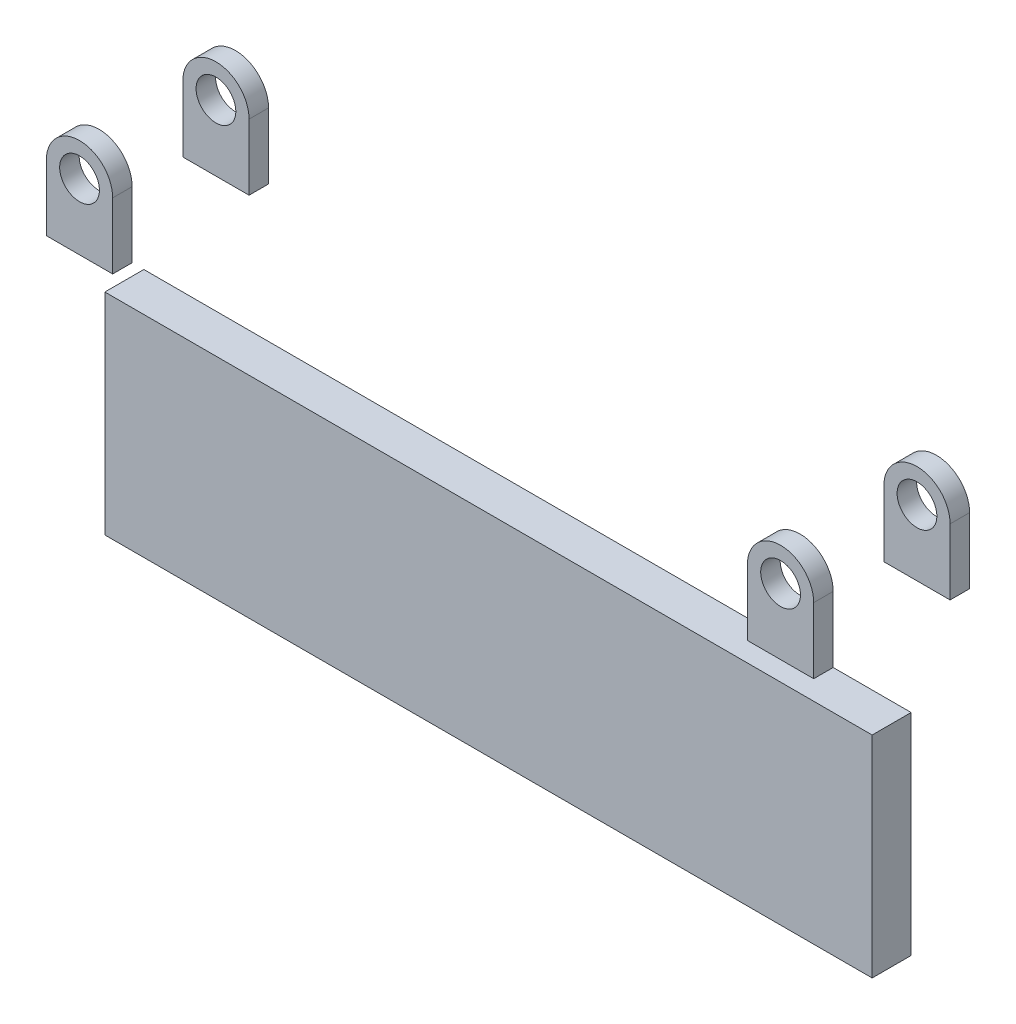
ISO-10303-21;
HEADER;
FILE_DESCRIPTION(('STEP AP214'),'2;1');
FILE_NAME('part.step','',(''),(''),'','','');
FILE_SCHEMA(('AUTOMOTIVE_DESIGN { 1 0 10303 214 1 1 1 1 }'));
ENDSEC;
DATA;
#1=APPLICATION_CONTEXT('core data for automotive mechanical design processes');
#2=APPLICATION_PROTOCOL_DEFINITION('international standard','automotive_design',2000,#1);
#3=PRODUCT_CONTEXT('',#1,'mechanical');
#4=PRODUCT('Part','Part','',(#3));
#5=PRODUCT_RELATED_PRODUCT_CATEGORY('part','',(#4));
#6=PRODUCT_DEFINITION_FORMATION('','',#4);
#7=PRODUCT_DEFINITION_CONTEXT('part definition',#1,'design');
#8=PRODUCT_DEFINITION('design','',#6,#7);
#9=PRODUCT_DEFINITION_SHAPE('','',#8);
#10=(LENGTH_UNIT() NAMED_UNIT(*) SI_UNIT(.MILLI.,.METRE.));
#11=(NAMED_UNIT(*) PLANE_ANGLE_UNIT() SI_UNIT($,.RADIAN.));
#12=(NAMED_UNIT(*) SI_UNIT($,.STERADIAN.) SOLID_ANGLE_UNIT());
#13=UNCERTAINTY_MEASURE_WITH_UNIT(LENGTH_MEASURE(1.E-05),#10,'distance_accuracy_value','');
#14=(GEOMETRIC_REPRESENTATION_CONTEXT(3) GLOBAL_UNCERTAINTY_ASSIGNED_CONTEXT((#13)) GLOBAL_UNIT_ASSIGNED_CONTEXT((#10,
#11,#12)) REPRESENTATION_CONTEXT('',''));
#15=CARTESIAN_POINT('',(0.,0.,0.));
#16=DIRECTION('',(0.,0.,1.));
#17=DIRECTION('',(1.,0.,0.));
#18=AXIS2_PLACEMENT_3D('',#15,#16,#17);
#19=CARTESIAN_POINT('',(-10.795,-115.457155865478,31.75));
#20=DIRECTION('',(1.,0.,0.));
#21=DIRECTION('',(0.,1.,0.));
#22=AXIS2_PLACEMENT_3D('',#19,#20,#21);
#23=PLANE('',#22);
#24=DIRECTION('',(0.,0.,1.));
#25=VECTOR('',#24,1.);
#26=CARTESIAN_POINT('',(-10.795,-46.8771558654777,19.05));
#27=LINE('',#26,#25);
#28=CARTESIAN_POINT('',(-10.795,-46.8771558654777,19.05));
#29=VERTEX_POINT('',#28);
#30=CARTESIAN_POINT('',(-10.795,-46.8771558654777,31.75));
#31=VERTEX_POINT('',#30);
#32=EDGE_CURVE('E65',#29,#31,#27,.T.);
#33=ORIENTED_EDGE('',*,*,#32,.F.);
#34=DIRECTION('',(0.,1.,0.));
#35=VECTOR('',#34,1.);
#36=CARTESIAN_POINT('',(-10.795,-115.457155865478,19.05));
#37=LINE('',#36,#35);
#38=CARTESIAN_POINT('',(-10.795,-115.457155865478,19.05));
#39=VERTEX_POINT('',#38);
#40=EDGE_CURVE('E12',#39,#29,#37,.T.);
#41=ORIENTED_EDGE('',*,*,#40,.F.);
#42=DIRECTION('',(0.,0.,-1.));
#43=VECTOR('',#42,1.);
#44=CARTESIAN_POINT('',(-10.795,-115.457155865478,31.75));
#45=LINE('',#44,#43);
#46=CARTESIAN_POINT('',(-10.795,-115.457155865478,31.75));
#47=VERTEX_POINT('',#46);
#48=EDGE_CURVE('E112',#47,#39,#45,.T.);
#49=ORIENTED_EDGE('',*,*,#48,.F.);
#50=DIRECTION('',(0.,1.,0.));
#51=VECTOR('',#50,1.);
#52=CARTESIAN_POINT('',(-10.795,-115.457155865478,31.75));
#53=LINE('',#52,#51);
#54=EDGE_CURVE('E103',#47,#31,#53,.T.);
#55=ORIENTED_EDGE('',*,*,#54,.T.);
#56=EDGE_LOOP('',(#33,#41,#49,#55));
#57=FACE_BOUND('',#56,.T.);
#58=ADVANCED_FACE('F50',(#57),#23,.F.);
#59=CARTESIAN_POINT('',(-10.795,-115.457155865478,19.05));
#60=DIRECTION('',(0.,0.,1.));
#61=DIRECTION('',(1.,0.,0.));
#62=AXIS2_PLACEMENT_3D('',#59,#60,#61);
#63=PLANE('',#62);
#64=DIRECTION('',(-1.,0.,0.));
#65=VECTOR('',#64,1.);
#66=CARTESIAN_POINT('',(239.2426,-46.8771558654776,19.05));
#67=LINE('',#66,#65);
#68=CARTESIAN_POINT('',(239.2426,-46.8771558654776,19.05));
#69=VERTEX_POINT('',#68);
#70=EDGE_CURVE('E90',#69,#29,#67,.T.);
#71=ORIENTED_EDGE('',*,*,#70,.F.);
#72=DIRECTION('',(0.,1.,0.));
#73=VECTOR('',#72,1.);
#74=CARTESIAN_POINT('',(239.2426,-115.457155865478,19.05));
#75=LINE('',#74,#73);
#76=CARTESIAN_POINT('',(239.2426,-115.457155865478,19.05));
#77=VERTEX_POINT('',#76);
#78=EDGE_CURVE('E58',#77,#69,#75,.T.);
#79=ORIENTED_EDGE('',*,*,#78,.F.);
#80=DIRECTION('',(1.,0.,0.));
#81=VECTOR('',#80,1.);
#82=CARTESIAN_POINT('',(-10.795,-115.457155865478,19.05));
#83=LINE('',#82,#81);
#84=EDGE_CURVE('E108',#39,#77,#83,.T.);
#85=ORIENTED_EDGE('',*,*,#84,.F.);
#86=ORIENTED_EDGE('',*,*,#40,.T.);
#87=EDGE_LOOP('',(#71,#79,#85,#86));
#88=FACE_BOUND('',#87,.T.);
#89=ADVANCED_FACE('F107',(#88),#63,.F.);
#90=CARTESIAN_POINT('',(239.2426,-115.457155865478,31.75));
#91=DIRECTION('',(-1.,0.,0.));
#92=DIRECTION('',(0.,-1.,0.));
#93=AXIS2_PLACEMENT_3D('',#90,#91,#92);
#94=PLANE('',#93);
#95=DIRECTION('',(0.,0.,-1.));
#96=VECTOR('',#95,1.);
#97=CARTESIAN_POINT('',(239.2426,-46.8771558654776,31.75));
#98=LINE('',#97,#96);
#99=CARTESIAN_POINT('',(239.2426,-46.8771558654776,31.75));
#100=VERTEX_POINT('',#99);
#101=EDGE_CURVE('E93',#100,#69,#98,.T.);
#102=ORIENTED_EDGE('',*,*,#101,.F.);
#103=DIRECTION('',(0.,1.,0.));
#104=VECTOR('',#103,1.);
#105=CARTESIAN_POINT('',(239.2426,-115.457155865478,31.75));
#106=LINE('',#105,#104);
#107=CARTESIAN_POINT('',(239.2426,-115.457155865478,31.75));
#108=VERTEX_POINT('',#107);
#109=EDGE_CURVE('E127',#108,#100,#106,.T.);
#110=ORIENTED_EDGE('',*,*,#109,.F.);
#111=DIRECTION('',(0.,0.,1.));
#112=VECTOR('',#111,1.);
#113=CARTESIAN_POINT('',(239.2426,-115.457155865478,31.75));
#114=LINE('',#113,#112);
#115=EDGE_CURVE('E111',#77,#108,#114,.T.);
#116=ORIENTED_EDGE('',*,*,#115,.F.);
#117=ORIENTED_EDGE('',*,*,#78,.T.);
#118=EDGE_LOOP('',(#102,#110,#116,#117));
#119=FACE_BOUND('',#118,.T.);
#120=ADVANCED_FACE('F132',(#119),#94,.F.);
#121=CARTESIAN_POINT('',(-10.795,-115.457155865478,31.75));
#122=DIRECTION('',(0.,0.,-1.));
#123=DIRECTION('',(-1.,0.,0.));
#124=AXIS2_PLACEMENT_3D('',#121,#122,#123);
#125=PLANE('',#124);
#126=DIRECTION('',(1.,0.,0.));
#127=VECTOR('',#126,1.);
#128=CARTESIAN_POINT('',(-10.795,-46.8771558654777,31.75));
#129=LINE('',#128,#127);
#130=EDGE_CURVE('E105',#31,#100,#129,.T.);
#131=ORIENTED_EDGE('',*,*,#130,.F.);
#132=ORIENTED_EDGE('',*,*,#54,.F.);
#133=DIRECTION('',(-1.,0.,0.));
#134=VECTOR('',#133,1.);
#135=CARTESIAN_POINT('',(-10.795,-115.457155865478,31.75));
#136=LINE('',#135,#134);
#137=EDGE_CURVE('E73',#108,#47,#136,.T.);
#138=ORIENTED_EDGE('',*,*,#137,.F.);
#139=ORIENTED_EDGE('',*,*,#109,.T.);
#140=EDGE_LOOP('',(#131,#132,#138,#139));
#141=FACE_BOUND('',#140,.T.);
#142=ADVANCED_FACE('F135',(#141),#125,.F.);
#143=CARTESIAN_POINT('',(0.,-115.457155865478,0.));
#144=DIRECTION('',(0.,-1.,0.));
#145=DIRECTION('',(1.,0.,0.));
#146=AXIS2_PLACEMENT_3D('',#143,#144,#145);
#147=PLANE('',#146);
#148=ORIENTED_EDGE('',*,*,#48,.T.);
#149=ORIENTED_EDGE('',*,*,#84,.T.);
#150=ORIENTED_EDGE('',*,*,#115,.T.);
#151=ORIENTED_EDGE('',*,*,#137,.T.);
#152=EDGE_LOOP('',(#148,#149,#150,#151));
#153=FACE_BOUND('',#152,.T.);
#154=ADVANCED_FACE('F114',(#153),#147,.T.);
#155=CARTESIAN_POINT('',(0.,-46.8771558654777,0.));
#156=DIRECTION('',(0.,1.,0.));
#157=DIRECTION('',(-1.,0.,0.));
#158=AXIS2_PLACEMENT_3D('',#155,#156,#157);
#159=PLANE('',#158);
#160=ORIENTED_EDGE('',*,*,#70,.T.);
#161=ORIENTED_EDGE('',*,*,#32,.T.);
#162=ORIENTED_EDGE('',*,*,#130,.T.);
#163=ORIENTED_EDGE('',*,*,#101,.T.);
#164=EDGE_LOOP('',(#160,#161,#162,#163));
#165=FACE_BOUND('',#164,.T.);
#166=ADVANCED_FACE('F91',(#165),#159,.T.);
#167=CLOSED_SHELL('',(#58,#89,#120,#142,#154,#166));
#168=MANIFOLD_SOLID_BREP('B2',#167);
#169=CARTESIAN_POINT('',(228.4476,0.,50.8));
#170=DIRECTION('',(0.,0.,-1.));
#171=DIRECTION('',(-1.,0.,0.));
#172=AXIS2_PLACEMENT_3D('',#169,#170,#171);
#173=CYLINDRICAL_SURFACE('',#172,10.795);
#174=DIRECTION('',(0.,0.,-1.));
#175=VECTOR('',#174,1.);
#176=CARTESIAN_POINT('',(239.2426,0.,50.8));
#177=LINE('',#176,#175);
#178=CARTESIAN_POINT('',(239.2426,0.,50.8));
#179=VERTEX_POINT('',#178);
#180=CARTESIAN_POINT('',(239.2426,0.,44.45));
#181=VERTEX_POINT('',#180);
#182=EDGE_CURVE('E199',#179,#181,#177,.T.);
#183=ORIENTED_EDGE('',*,*,#182,.T.);
#184=CARTESIAN_POINT('',(228.4476,0.,44.45));
#185=DIRECTION('',(0.,0.,1.));
#186=DIRECTION('',(1.,0.,0.));
#187=AXIS2_PLACEMENT_3D('',#184,#185,#186);
#188=CIRCLE('',#187,10.795);
#189=CARTESIAN_POINT('',(217.6526,0.,44.45));
#190=VERTEX_POINT('',#189);
#191=EDGE_CURVE('E213',#181,#190,#188,.T.);
#192=ORIENTED_EDGE('',*,*,#191,.T.);
#193=DIRECTION('',(0.,0.,-1.));
#194=VECTOR('',#193,1.);
#195=CARTESIAN_POINT('',(217.6526,0.,50.8));
#196=LINE('',#195,#194);
#197=CARTESIAN_POINT('',(217.6526,0.,50.8));
#198=VERTEX_POINT('',#197);
#199=EDGE_CURVE('E257',#198,#190,#196,.T.);
#200=ORIENTED_EDGE('',*,*,#199,.F.);
#201=CARTESIAN_POINT('',(228.4476,0.,50.8));
#202=DIRECTION('',(0.,0.,1.));
#203=DIRECTION('',(1.,0.,0.));
#204=AXIS2_PLACEMENT_3D('',#201,#202,#203);
#205=CIRCLE('',#204,10.795);
#206=EDGE_CURVE('E252',#179,#198,#205,.T.);
#207=ORIENTED_EDGE('',*,*,#206,.F.);
#208=EDGE_LOOP('',(#183,#192,#200,#207));
#209=FACE_BOUND('',#208,.T.);
#210=ADVANCED_FACE('F195',(#209),#173,.T.);
#211=CARTESIAN_POINT('',(217.6526,0.,50.8));
#212=DIRECTION('',(1.,0.,0.));
#213=DIRECTION('',(0.,0.,-1.));
#214=AXIS2_PLACEMENT_3D('',#211,#212,#213);
#215=PLANE('',#214);
#216=ORIENTED_EDGE('',*,*,#199,.T.);
#217=DIRECTION('',(0.,-1.,0.));
#218=VECTOR('',#217,1.);
#219=CARTESIAN_POINT('',(217.6526,0.,44.45));
#220=LINE('',#219,#218);
#221=CARTESIAN_POINT('',(217.6526,-21.4771558654776,44.45));
#222=VERTEX_POINT('',#221);
#223=EDGE_CURVE('E256',#190,#222,#220,.T.);
#224=ORIENTED_EDGE('',*,*,#223,.T.);
#225=DIRECTION('',(0.,0.,-1.));
#226=VECTOR('',#225,1.);
#227=CARTESIAN_POINT('',(217.6526,-21.4771558654776,50.8));
#228=LINE('',#227,#226);
#229=CARTESIAN_POINT('',(217.6526,-21.4771558654776,50.8));
#230=VERTEX_POINT('',#229);
#231=EDGE_CURVE('E246',#230,#222,#228,.T.);
#232=ORIENTED_EDGE('',*,*,#231,.F.);
#233=DIRECTION('',(0.,-1.,0.));
#234=VECTOR('',#233,1.);
#235=CARTESIAN_POINT('',(217.6526,0.,50.8));
#236=LINE('',#235,#234);
#237=EDGE_CURVE('E264',#198,#230,#236,.T.);
#238=ORIENTED_EDGE('',*,*,#237,.F.);
#239=EDGE_LOOP('',(#216,#224,#232,#238));
#240=FACE_BOUND('',#239,.T.);
#241=ADVANCED_FACE('F286',(#240),#215,.F.);
#242=CARTESIAN_POINT('',(239.2426,-21.4771558654776,50.8));
#243=DIRECTION('',(0.,1.,0.));
#244=DIRECTION('',(0.,0.,1.));
#245=AXIS2_PLACEMENT_3D('',#242,#243,#244);
#246=PLANE('',#245);
#247=ORIENTED_EDGE('',*,*,#231,.T.);
#248=DIRECTION('',(1.,0.,0.));
#249=VECTOR('',#248,1.);
#250=CARTESIAN_POINT('',(-27.9654000000002,-21.4771558654776,44.45));
#251=LINE('',#250,#249);
#252=CARTESIAN_POINT('',(239.2426,-21.4771558654776,44.45));
#253=VERTEX_POINT('',#252);
#254=EDGE_CURVE('E231',#222,#253,#251,.T.);
#255=ORIENTED_EDGE('',*,*,#254,.T.);
#256=DIRECTION('',(0.,0.,-1.));
#257=VECTOR('',#256,1.);
#258=CARTESIAN_POINT('',(239.2426,-21.4771558654776,50.8));
#259=LINE('',#258,#257);
#260=CARTESIAN_POINT('',(239.2426,-21.4771558654776,50.8));
#261=VERTEX_POINT('',#260);
#262=EDGE_CURVE('E243',#261,#253,#259,.T.);
#263=ORIENTED_EDGE('',*,*,#262,.F.);
#264=DIRECTION('',(1.,0.,0.));
#265=VECTOR('',#264,1.);
#266=CARTESIAN_POINT('',(239.2426,-21.4771558654776,50.8));
#267=LINE('',#266,#265);
#268=EDGE_CURVE('E266',#230,#261,#267,.T.);
#269=ORIENTED_EDGE('',*,*,#268,.F.);
#270=EDGE_LOOP('',(#247,#255,#263,#269));
#271=FACE_BOUND('',#270,.T.);
#272=ADVANCED_FACE('F241',(#271),#246,.F.);
#273=CARTESIAN_POINT('',(239.2426,0.,50.8));
#274=DIRECTION('',(-1.,0.,0.));
#275=DIRECTION('',(0.,0.,1.));
#276=AXIS2_PLACEMENT_3D('',#273,#274,#275);
#277=PLANE('',#276);
#278=ORIENTED_EDGE('',*,*,#262,.T.);
#279=DIRECTION('',(0.,-1.,0.));
#280=VECTOR('',#279,1.);
#281=CARTESIAN_POINT('',(239.2426,14.8646023679012,44.45));
#282=LINE('',#281,#280);
#283=EDGE_CURVE('E48',#181,#253,#282,.T.);
#284=ORIENTED_EDGE('',*,*,#283,.F.);
#285=ORIENTED_EDGE('',*,*,#182,.F.);
#286=DIRECTION('',(0.,1.,0.));
#287=VECTOR('',#286,1.);
#288=CARTESIAN_POINT('',(239.2426,0.,50.8));
#289=LINE('',#288,#287);
#290=EDGE_CURVE('E249',#261,#179,#289,.T.);
#291=ORIENTED_EDGE('',*,*,#290,.F.);
#292=EDGE_LOOP('',(#278,#284,#285,#291));
#293=FACE_BOUND('',#292,.T.);
#294=ADVANCED_FACE('F248',(#293),#277,.F.);
#295=CARTESIAN_POINT('',(228.4476,0.,50.8));
#296=DIRECTION('',(0.,0.,-1.));
#297=DIRECTION('',(-1.,0.,0.));
#298=AXIS2_PLACEMENT_3D('',#295,#296,#297);
#299=CYLINDRICAL_SURFACE('',#298,6.47700000000001);
#300=CARTESIAN_POINT('',(228.4476,0.,44.45));
#301=DIRECTION('',(0.,0.,1.));
#302=DIRECTION('',(1.,0.,0.));
#303=AXIS2_PLACEMENT_3D('',#300,#301,#302);
#304=CIRCLE('',#303,6.47700000000001);
#305=CARTESIAN_POINT('',(234.9246,0.,44.45));
#306=VERTEX_POINT('',#305);
#307=EDGE_CURVE('E205',#306,#306,#304,.T.);
#308=ORIENTED_EDGE('',*,*,#307,.F.);
#309=EDGE_LOOP('',(#308));
#310=FACE_BOUND('',#309,.T.);
#311=CARTESIAN_POINT('',(228.4476,0.,50.8));
#312=DIRECTION('',(0.,0.,1.));
#313=DIRECTION('',(1.,0.,0.));
#314=AXIS2_PLACEMENT_3D('',#311,#312,#313);
#315=CIRCLE('',#314,6.47700000000001);
#316=CARTESIAN_POINT('',(234.9246,0.,50.8));
#317=VERTEX_POINT('',#316);
#318=EDGE_CURVE('E250',#317,#317,#315,.T.);
#319=ORIENTED_EDGE('',*,*,#318,.T.);
#320=EDGE_LOOP('',(#319));
#321=FACE_BOUND('',#320,.T.);
#322=ADVANCED_FACE('F197',(#310,#321),#299,.F.);
#323=CARTESIAN_POINT('',(228.4476,0.,50.8));
#324=DIRECTION('',(0.,0.,1.));
#325=DIRECTION('',(1.,0.,0.));
#326=AXIS2_PLACEMENT_3D('',#323,#324,#325);
#327=PLANE('',#326);
#328=ORIENTED_EDGE('',*,*,#206,.T.);
#329=ORIENTED_EDGE('',*,*,#237,.T.);
#330=ORIENTED_EDGE('',*,*,#268,.T.);
#331=ORIENTED_EDGE('',*,*,#290,.T.);
#332=EDGE_LOOP('',(#328,#329,#330,#331));
#333=FACE_BOUND('',#332,.T.);
#334=ORIENTED_EDGE('',*,*,#318,.F.);
#335=EDGE_LOOP('',(#334));
#336=FACE_BOUND('',#335,.T.);
#337=ADVANCED_FACE('F275',(#333,#336),#327,.T.);
#338=CARTESIAN_POINT('',(-27.9654000000002,14.8646023679012,44.45));
#339=DIRECTION('',(0.,0.,1.));
#340=DIRECTION('',(1.,0.,0.));
#341=AXIS2_PLACEMENT_3D('',#338,#339,#340);
#342=PLANE('',#341);
#343=ORIENTED_EDGE('',*,*,#307,.T.);
#344=EDGE_LOOP('',(#343));
#345=FACE_BOUND('',#344,.T.);
#346=ORIENTED_EDGE('',*,*,#283,.T.);
#347=ORIENTED_EDGE('',*,*,#254,.F.);
#348=ORIENTED_EDGE('',*,*,#223,.F.);
#349=ORIENTED_EDGE('',*,*,#191,.F.);
#350=EDGE_LOOP('',(#346,#347,#348,#349));
#351=FACE_BOUND('',#350,.T.);
#352=ADVANCED_FACE('F233',(#345,#351),#342,.F.);
#353=CLOSED_SHELL('',(#210,#241,#272,#294,#322,#337,#352));
#354=MANIFOLD_SOLID_BREP('B6',#353);
#355=CARTESIAN_POINT('',(0.,0.,50.8));
#356=DIRECTION('',(0.,0.,-1.));
#357=DIRECTION('',(-1.,0.,0.));
#358=AXIS2_PLACEMENT_3D('',#355,#356,#357);
#359=CYLINDRICAL_SURFACE('',#358,10.795);
#360=DIRECTION('',(0.,0.,-1.));
#361=VECTOR('',#360,1.);
#362=CARTESIAN_POINT('',(10.795,0.,50.8));
#363=LINE('',#362,#361);
#364=CARTESIAN_POINT('',(10.795,0.,50.8));
#365=VERTEX_POINT('',#364);
#366=CARTESIAN_POINT('',(10.795,0.,44.45));
#367=VERTEX_POINT('',#366);
#368=EDGE_CURVE('E353',#365,#367,#363,.T.);
#369=ORIENTED_EDGE('',*,*,#368,.T.);
#370=CARTESIAN_POINT('',(0.,0.,44.45));
#371=DIRECTION('',(0.,0.,1.));
#372=DIRECTION('',(1.,0.,0.));
#373=AXIS2_PLACEMENT_3D('',#370,#371,#372);
#374=CIRCLE('',#373,10.795);
#375=CARTESIAN_POINT('',(-10.795,0.,44.45));
#376=VERTEX_POINT('',#375);
#377=EDGE_CURVE('E380',#367,#376,#374,.T.);
#378=ORIENTED_EDGE('',*,*,#377,.T.);
#379=DIRECTION('',(0.,0.,-1.));
#380=VECTOR('',#379,1.);
#381=CARTESIAN_POINT('',(-10.795,0.,50.8));
#382=LINE('',#381,#380);
#383=CARTESIAN_POINT('',(-10.795,0.,50.8));
#384=VERTEX_POINT('',#383);
#385=EDGE_CURVE('E397',#384,#376,#382,.T.);
#386=ORIENTED_EDGE('',*,*,#385,.F.);
#387=CARTESIAN_POINT('',(0.,0.,50.8));
#388=DIRECTION('',(0.,0.,1.));
#389=DIRECTION('',(1.,0.,0.));
#390=AXIS2_PLACEMENT_3D('',#387,#388,#389);
#391=CIRCLE('',#390,10.795);
#392=EDGE_CURVE('E402',#365,#384,#391,.T.);
#393=ORIENTED_EDGE('',*,*,#392,.F.);
#394=EDGE_LOOP('',(#369,#378,#386,#393));
#395=FACE_BOUND('',#394,.T.);
#396=ADVANCED_FACE('F349',(#395),#359,.T.);
#397=CARTESIAN_POINT('',(-10.795,0.,50.8));
#398=DIRECTION('',(1.,0.,0.));
#399=DIRECTION('',(0.,0.,-1.));
#400=AXIS2_PLACEMENT_3D('',#397,#398,#399);
#401=PLANE('',#400);
#402=ORIENTED_EDGE('',*,*,#385,.T.);
#403=DIRECTION('',(0.,-1.,0.));
#404=VECTOR('',#403,1.);
#405=CARTESIAN_POINT('',(-10.795,0.,44.45));
#406=LINE('',#405,#404);
#407=CARTESIAN_POINT('',(-10.795,-21.4771558654776,44.45));
#408=VERTEX_POINT('',#407);
#409=EDGE_CURVE('E367',#376,#408,#406,.T.);
#410=ORIENTED_EDGE('',*,*,#409,.T.);
#411=DIRECTION('',(0.,0.,-1.));
#412=VECTOR('',#411,1.);
#413=CARTESIAN_POINT('',(-10.795,-21.4771558654777,50.8));
#414=LINE('',#413,#412);
#415=CARTESIAN_POINT('',(-10.795,-21.4771558654777,50.8));
#416=VERTEX_POINT('',#415);
#417=EDGE_CURVE('E399',#416,#408,#414,.T.);
#418=ORIENTED_EDGE('',*,*,#417,.F.);
#419=DIRECTION('',(0.,-1.,0.));
#420=VECTOR('',#419,1.);
#421=CARTESIAN_POINT('',(-10.795,0.,50.8));
#422=LINE('',#421,#420);
#423=EDGE_CURVE('E391',#384,#416,#422,.T.);
#424=ORIENTED_EDGE('',*,*,#423,.F.);
#425=EDGE_LOOP('',(#402,#410,#418,#424));
#426=FACE_BOUND('',#425,.T.);
#427=ADVANCED_FACE('F395',(#426),#401,.F.);
#428=CARTESIAN_POINT('',(10.795,-21.4771558654777,50.8));
#429=DIRECTION('',(0.,1.,0.));
#430=DIRECTION('',(-1.,0.,0.));
#431=AXIS2_PLACEMENT_3D('',#428,#429,#430);
#432=PLANE('',#431);
#433=ORIENTED_EDGE('',*,*,#417,.T.);
#434=DIRECTION('',(1.,0.,0.));
#435=VECTOR('',#434,1.);
#436=CARTESIAN_POINT('',(-27.9654000000002,-21.4771558654776,44.45));
#437=LINE('',#436,#435);
#438=CARTESIAN_POINT('',(10.795,-21.4771558654776,44.45));
#439=VERTEX_POINT('',#438);
#440=EDGE_CURVE('E418',#408,#439,#437,.T.);
#441=ORIENTED_EDGE('',*,*,#440,.T.);
#442=DIRECTION('',(0.,0.,-1.));
#443=VECTOR('',#442,1.);
#444=CARTESIAN_POINT('',(10.795,-21.4771558654777,50.8));
#445=LINE('',#444,#443);
#446=CARTESIAN_POINT('',(10.795,-21.4771558654777,50.8));
#447=VERTEX_POINT('',#446);
#448=EDGE_CURVE('E420',#447,#439,#445,.T.);
#449=ORIENTED_EDGE('',*,*,#448,.F.);
#450=DIRECTION('',(1.,0.,0.));
#451=VECTOR('',#450,1.);
#452=CARTESIAN_POINT('',(10.795,-21.4771558654777,50.8));
#453=LINE('',#452,#451);
#454=EDGE_CURVE('E401',#416,#447,#453,.T.);
#455=ORIENTED_EDGE('',*,*,#454,.F.);
#456=EDGE_LOOP('',(#433,#441,#449,#455));
#457=FACE_BOUND('',#456,.T.);
#458=ADVANCED_FACE('F425',(#457),#432,.F.);
#459=CARTESIAN_POINT('',(10.795,0.,50.8));
#460=DIRECTION('',(-1.,0.,0.));
#461=DIRECTION('',(0.,0.,1.));
#462=AXIS2_PLACEMENT_3D('',#459,#460,#461);
#463=PLANE('',#462);
#464=ORIENTED_EDGE('',*,*,#448,.T.);
#465=DIRECTION('',(0.,1.,0.));
#466=VECTOR('',#465,1.);
#467=CARTESIAN_POINT('',(10.795,0.,44.45));
#468=LINE('',#467,#466);
#469=EDGE_CURVE('E376',#439,#367,#468,.T.);
#470=ORIENTED_EDGE('',*,*,#469,.T.);
#471=ORIENTED_EDGE('',*,*,#368,.F.);
#472=DIRECTION('',(0.,1.,0.));
#473=VECTOR('',#472,1.);
#474=CARTESIAN_POINT('',(10.795,0.,50.8));
#475=LINE('',#474,#473);
#476=EDGE_CURVE('E359',#447,#365,#475,.T.);
#477=ORIENTED_EDGE('',*,*,#476,.F.);
#478=EDGE_LOOP('',(#464,#470,#471,#477));
#479=FACE_BOUND('',#478,.T.);
#480=ADVANCED_FACE('F442',(#479),#463,.F.);
#481=CARTESIAN_POINT('',(0.,0.,50.8));
#482=DIRECTION('',(0.,0.,-1.));
#483=DIRECTION('',(-1.,0.,0.));
#484=AXIS2_PLACEMENT_3D('',#481,#482,#483);
#485=CYLINDRICAL_SURFACE('',#484,6.477);
#486=CARTESIAN_POINT('',(0.,0.,44.45));
#487=DIRECTION('',(0.,0.,1.));
#488=DIRECTION('',(1.,0.,0.));
#489=AXIS2_PLACEMENT_3D('',#486,#487,#488);
#490=CIRCLE('',#489,6.477);
#491=CARTESIAN_POINT('',(6.477,0.,44.45));
#492=VERTEX_POINT('',#491);
#493=EDGE_CURVE('E193',#492,#492,#490,.T.);
#494=ORIENTED_EDGE('',*,*,#493,.F.);
#495=EDGE_LOOP('',(#494));
#496=FACE_BOUND('',#495,.T.);
#497=CARTESIAN_POINT('',(0.,0.,50.8));
#498=DIRECTION('',(0.,0.,1.));
#499=DIRECTION('',(1.,0.,0.));
#500=AXIS2_PLACEMENT_3D('',#497,#498,#499);
#501=CIRCLE('',#500,6.477);
#502=CARTESIAN_POINT('',(6.477,0.,50.8));
#503=VERTEX_POINT('',#502);
#504=EDGE_CURVE('E411',#503,#503,#501,.T.);
#505=ORIENTED_EDGE('',*,*,#504,.T.);
#506=EDGE_LOOP('',(#505));
#507=FACE_BOUND('',#506,.T.);
#508=ADVANCED_FACE('F351',(#496,#507),#485,.F.);
#509=CARTESIAN_POINT('',(0.,0.,50.8));
#510=DIRECTION('',(0.,0.,1.));
#511=DIRECTION('',(1.,0.,0.));
#512=AXIS2_PLACEMENT_3D('',#509,#510,#511);
#513=PLANE('',#512);
#514=ORIENTED_EDGE('',*,*,#392,.T.);
#515=ORIENTED_EDGE('',*,*,#423,.T.);
#516=ORIENTED_EDGE('',*,*,#454,.T.);
#517=ORIENTED_EDGE('',*,*,#476,.T.);
#518=EDGE_LOOP('',(#514,#515,#516,#517));
#519=FACE_BOUND('',#518,.T.);
#520=ORIENTED_EDGE('',*,*,#504,.F.);
#521=EDGE_LOOP('',(#520));
#522=FACE_BOUND('',#521,.T.);
#523=ADVANCED_FACE('F405',(#519,#522),#513,.T.);
#524=CARTESIAN_POINT('',(-27.9654000000002,14.8646023679012,44.45));
#525=DIRECTION('',(0.,0.,1.));
#526=DIRECTION('',(1.,0.,0.));
#527=AXIS2_PLACEMENT_3D('',#524,#525,#526);
#528=PLANE('',#527);
#529=ORIENTED_EDGE('',*,*,#493,.T.);
#530=EDGE_LOOP('',(#529));
#531=FACE_BOUND('',#530,.T.);
#532=ORIENTED_EDGE('',*,*,#377,.F.);
#533=ORIENTED_EDGE('',*,*,#469,.F.);
#534=ORIENTED_EDGE('',*,*,#440,.F.);
#535=ORIENTED_EDGE('',*,*,#409,.F.);
#536=EDGE_LOOP('',(#532,#533,#534,#535));
#537=FACE_BOUND('',#536,.T.);
#538=ADVANCED_FACE('F426',(#531,#537),#528,.F.);
#539=CLOSED_SHELL('',(#396,#427,#458,#480,#508,#523,#538));
#540=MANIFOLD_SOLID_BREP('B42',#539);
#541=CARTESIAN_POINT('',(239.2426,0.,50.8));
#542=DIRECTION('',(-1.,0.,0.));
#543=DIRECTION('',(0.,0.,1.));
#544=AXIS2_PLACEMENT_3D('',#541,#542,#543);
#545=PLANE('',#544);
#546=DIRECTION('',(0.,0.,-1.));
#547=VECTOR('',#546,1.);
#548=CARTESIAN_POINT('',(239.2426,0.,50.8));
#549=LINE('',#548,#547);
#550=CARTESIAN_POINT('',(239.2426,0.,6.35));
#551=VERTEX_POINT('',#550);
#552=CARTESIAN_POINT('',(239.2426,0.,0.));
#553=VERTEX_POINT('',#552);
#554=EDGE_CURVE('E526',#551,#553,#549,.T.);
#555=ORIENTED_EDGE('',*,*,#554,.F.);
#556=DIRECTION('',(0.,1.,0.));
#557=VECTOR('',#556,1.);
#558=CARTESIAN_POINT('',(239.2426,14.8646023679012,6.35));
#559=LINE('',#558,#557);
#560=CARTESIAN_POINT('',(239.2426,-21.4771558654776,6.34999999999999));
#561=VERTEX_POINT('',#560);
#562=EDGE_CURVE('E542',#561,#551,#559,.T.);
#563=ORIENTED_EDGE('',*,*,#562,.F.);
#564=DIRECTION('',(0.,0.,-1.));
#565=VECTOR('',#564,1.);
#566=CARTESIAN_POINT('',(239.2426,-21.4771558654776,50.8));
#567=LINE('',#566,#565);
#568=CARTESIAN_POINT('',(239.2426,-21.4771558654776,0.));
#569=VERTEX_POINT('',#568);
#570=EDGE_CURVE('E556',#561,#569,#567,.T.);
#571=ORIENTED_EDGE('',*,*,#570,.T.);
#572=DIRECTION('',(0.,1.,0.));
#573=VECTOR('',#572,1.);
#574=CARTESIAN_POINT('',(239.2426,0.,0.));
#575=LINE('',#574,#573);
#576=EDGE_CURVE('E554',#569,#553,#575,.T.);
#577=ORIENTED_EDGE('',*,*,#576,.T.);
#578=EDGE_LOOP('',(#555,#563,#571,#577));
#579=FACE_BOUND('',#578,.T.);
#580=ADVANCED_FACE('F502',(#579),#545,.F.);
#581=CARTESIAN_POINT('',(239.2426,-21.4771558654776,50.8));
#582=DIRECTION('',(0.,1.,0.));
#583=DIRECTION('',(0.,0.,1.));
#584=AXIS2_PLACEMENT_3D('',#581,#582,#583);
#585=PLANE('',#584);
#586=ORIENTED_EDGE('',*,*,#570,.F.);
#587=DIRECTION('',(1.,0.,0.));
#588=VECTOR('',#587,1.);
#589=CARTESIAN_POINT('',(-27.9654000000002,-21.4771558654776,6.34999999999999));
#590=LINE('',#589,#588);
#591=CARTESIAN_POINT('',(217.6526,-21.4771558654776,6.34999999999999));
#592=VERTEX_POINT('',#591);
#593=EDGE_CURVE('E518',#592,#561,#590,.T.);
#594=ORIENTED_EDGE('',*,*,#593,.F.);
#595=DIRECTION('',(0.,0.,-1.));
#596=VECTOR('',#595,1.);
#597=CARTESIAN_POINT('',(217.6526,-21.4771558654776,50.8));
#598=LINE('',#597,#596);
#599=CARTESIAN_POINT('',(217.6526,-21.4771558654776,0.));
#600=VERTEX_POINT('',#599);
#601=EDGE_CURVE('E511',#592,#600,#598,.T.);
#602=ORIENTED_EDGE('',*,*,#601,.T.);
#603=DIRECTION('',(1.,0.,0.));
#604=VECTOR('',#603,1.);
#605=CARTESIAN_POINT('',(239.2426,-21.4771558654776,0.));
#606=LINE('',#605,#604);
#607=EDGE_CURVE('E559',#600,#569,#606,.T.);
#608=ORIENTED_EDGE('',*,*,#607,.T.);
#609=EDGE_LOOP('',(#586,#594,#602,#608));
#610=FACE_BOUND('',#609,.T.);
#611=ADVANCED_FACE('F567',(#610),#585,.F.);
#612=CARTESIAN_POINT('',(217.6526,0.,50.8));
#613=DIRECTION('',(1.,0.,0.));
#614=DIRECTION('',(0.,0.,-1.));
#615=AXIS2_PLACEMENT_3D('',#612,#613,#614);
#616=PLANE('',#615);
#617=ORIENTED_EDGE('',*,*,#601,.F.);
#618=DIRECTION('',(0.,1.,0.));
#619=VECTOR('',#618,1.);
#620=CARTESIAN_POINT('',(217.6526,0.,6.35));
#621=LINE('',#620,#619);
#622=CARTESIAN_POINT('',(217.6526,0.,6.35));
#623=VERTEX_POINT('',#622);
#624=EDGE_CURVE('E551',#592,#623,#621,.T.);
#625=ORIENTED_EDGE('',*,*,#624,.T.);
#626=DIRECTION('',(0.,0.,-1.));
#627=VECTOR('',#626,1.);
#628=CARTESIAN_POINT('',(217.6526,0.,50.8));
#629=LINE('',#628,#627);
#630=CARTESIAN_POINT('',(217.6526,0.,0.));
#631=VERTEX_POINT('',#630);
#632=EDGE_CURVE('E347',#623,#631,#629,.T.);
#633=ORIENTED_EDGE('',*,*,#632,.T.);
#634=DIRECTION('',(0.,-1.,0.));
#635=VECTOR('',#634,1.);
#636=CARTESIAN_POINT('',(217.6526,0.,0.));
#637=LINE('',#636,#635);
#638=EDGE_CURVE('E571',#631,#600,#637,.T.);
#639=ORIENTED_EDGE('',*,*,#638,.T.);
#640=EDGE_LOOP('',(#617,#625,#633,#639));
#641=FACE_BOUND('',#640,.T.);
#642=ADVANCED_FACE('F572',(#641),#616,.F.);
#643=CARTESIAN_POINT('',(228.4476,0.,50.8));
#644=DIRECTION('',(0.,0.,-1.));
#645=DIRECTION('',(-1.,0.,0.));
#646=AXIS2_PLACEMENT_3D('',#643,#644,#645);
#647=CYLINDRICAL_SURFACE('',#646,10.795);
#648=ORIENTED_EDGE('',*,*,#632,.F.);
#649=CARTESIAN_POINT('',(228.4476,0.,6.35));
#650=DIRECTION('',(0.,0.,-1.));
#651=DIRECTION('',(0.,1.,0.));
#652=AXIS2_PLACEMENT_3D('',#649,#650,#651);
#653=CIRCLE('',#652,10.795);
#654=EDGE_CURVE('E544',#623,#551,#653,.T.);
#655=ORIENTED_EDGE('',*,*,#654,.T.);
#656=ORIENTED_EDGE('',*,*,#554,.T.);
#657=CARTESIAN_POINT('',(228.4476,0.,0.));
#658=DIRECTION('',(0.,0.,1.));
#659=DIRECTION('',(1.,0.,0.));
#660=AXIS2_PLACEMENT_3D('',#657,#658,#659);
#661=CIRCLE('',#660,10.795);
#662=EDGE_CURVE('E574',#553,#631,#661,.T.);
#663=ORIENTED_EDGE('',*,*,#662,.T.);
#664=EDGE_LOOP('',(#648,#655,#656,#663));
#665=FACE_BOUND('',#664,.T.);
#666=ADVANCED_FACE('F504',(#665),#647,.T.);
#667=CARTESIAN_POINT('',(228.4476,0.,0.));
#668=DIRECTION('',(0.,0.,1.));
#669=DIRECTION('',(1.,0.,0.));
#670=AXIS2_PLACEMENT_3D('',#667,#668,#669);
#671=PLANE('',#670);
#672=ORIENTED_EDGE('',*,*,#662,.F.);
#673=ORIENTED_EDGE('',*,*,#576,.F.);
#674=ORIENTED_EDGE('',*,*,#607,.F.);
#675=ORIENTED_EDGE('',*,*,#638,.F.);
#676=EDGE_LOOP('',(#672,#673,#674,#675));
#677=FACE_BOUND('',#676,.T.);
#678=CARTESIAN_POINT('',(228.4476,0.,0.));
#679=DIRECTION('',(0.,0.,1.));
#680=DIRECTION('',(1.,0.,0.));
#681=AXIS2_PLACEMENT_3D('',#678,#679,#680);
#682=CIRCLE('',#681,6.47700000000001);
#683=CARTESIAN_POINT('',(234.9246,0.,0.));
#684=VERTEX_POINT('',#683);
#685=EDGE_CURVE('E550',#684,#684,#682,.T.);
#686=ORIENTED_EDGE('',*,*,#685,.T.);
#687=EDGE_LOOP('',(#686));
#688=FACE_BOUND('',#687,.T.);
#689=ADVANCED_FACE('F576',(#677,#688),#671,.F.);
#690=CARTESIAN_POINT('',(228.4476,0.,50.8));
#691=DIRECTION('',(0.,0.,-1.));
#692=DIRECTION('',(-1.,0.,0.));
#693=AXIS2_PLACEMENT_3D('',#690,#691,#692);
#694=CYLINDRICAL_SURFACE('',#693,6.47700000000001);
#695=CARTESIAN_POINT('',(228.4476,0.,6.35));
#696=DIRECTION('',(0.,0.,-1.));
#697=DIRECTION('',(0.,1.,0.));
#698=AXIS2_PLACEMENT_3D('',#695,#696,#697);
#699=CIRCLE('',#698,6.47700000000001);
#700=CARTESIAN_POINT('',(228.4476,6.47700000000004,6.35));
#701=VERTEX_POINT('',#700);
#702=EDGE_CURVE('E506',#701,#701,#699,.T.);
#703=ORIENTED_EDGE('',*,*,#702,.F.);
#704=EDGE_LOOP('',(#703));
#705=FACE_BOUND('',#704,.T.);
#706=ORIENTED_EDGE('',*,*,#685,.F.);
#707=EDGE_LOOP('',(#706));
#708=FACE_BOUND('',#707,.T.);
#709=ADVANCED_FACE('F587',(#705,#708),#694,.F.);
#710=CARTESIAN_POINT('',(-27.9654000000002,14.8646023679012,6.35));
#711=DIRECTION('',(0.,0.,-1.));
#712=DIRECTION('',(0.,1.,0.));
#713=AXIS2_PLACEMENT_3D('',#710,#711,#712);
#714=PLANE('',#713);
#715=ORIENTED_EDGE('',*,*,#702,.T.);
#716=EDGE_LOOP('',(#715));
#717=FACE_BOUND('',#716,.T.);
#718=ORIENTED_EDGE('',*,*,#624,.F.);
#719=ORIENTED_EDGE('',*,*,#593,.T.);
#720=ORIENTED_EDGE('',*,*,#562,.T.);
#721=ORIENTED_EDGE('',*,*,#654,.F.);
#722=EDGE_LOOP('',(#718,#719,#720,#721));
#723=FACE_BOUND('',#722,.T.);
#724=ADVANCED_FACE('F543',(#717,#723),#714,.F.);
#725=CLOSED_SHELL('',(#580,#611,#642,#666,#689,#709,#724));
#726=MANIFOLD_SOLID_BREP('B187',#725);
#727=CARTESIAN_POINT('',(10.795,0.,50.8));
#728=DIRECTION('',(-1.,0.,0.));
#729=DIRECTION('',(0.,0.,1.));
#730=AXIS2_PLACEMENT_3D('',#727,#728,#729);
#731=PLANE('',#730);
#732=DIRECTION('',(0.,0.,-1.));
#733=VECTOR('',#732,1.);
#734=CARTESIAN_POINT('',(10.795,0.,50.8));
#735=LINE('',#734,#733);
#736=CARTESIAN_POINT('',(10.795,0.,6.35));
#737=VERTEX_POINT('',#736);
#738=CARTESIAN_POINT('',(10.795,0.,0.));
#739=VERTEX_POINT('',#738);
#740=EDGE_CURVE('E670',#737,#739,#735,.T.);
#741=ORIENTED_EDGE('',*,*,#740,.F.);
#742=DIRECTION('',(0.,-1.,0.));
#743=VECTOR('',#742,1.);
#744=CARTESIAN_POINT('',(10.795,0.,6.35));
#745=LINE('',#744,#743);
#746=CARTESIAN_POINT('',(10.795,-21.4771558654777,6.34999999999999));
#747=VERTEX_POINT('',#746);
#748=EDGE_CURVE('E720',#737,#747,#745,.T.);
#749=ORIENTED_EDGE('',*,*,#748,.T.);
#750=DIRECTION('',(0.,0.,-1.));
#751=VECTOR('',#750,1.);
#752=CARTESIAN_POINT('',(10.795,-21.4771558654777,50.8));
#753=LINE('',#752,#751);
#754=CARTESIAN_POINT('',(10.795,-21.4771558654777,0.));
#755=VERTEX_POINT('',#754);
#756=EDGE_CURVE('E700',#747,#755,#753,.T.);
#757=ORIENTED_EDGE('',*,*,#756,.T.);
#758=DIRECTION('',(0.,1.,0.));
#759=VECTOR('',#758,1.);
#760=CARTESIAN_POINT('',(10.795,0.,0.));
#761=LINE('',#760,#759);
#762=EDGE_CURVE('E710',#755,#739,#761,.T.);
#763=ORIENTED_EDGE('',*,*,#762,.T.);
#764=EDGE_LOOP('',(#741,#749,#757,#763));
#765=FACE_BOUND('',#764,.T.);
#766=ADVANCED_FACE('F646',(#765),#731,.F.);
#767=CARTESIAN_POINT('',(10.795,-21.4771558654777,50.8));
#768=DIRECTION('',(0.,1.,0.));
#769=DIRECTION('',(-1.,0.,0.));
#770=AXIS2_PLACEMENT_3D('',#767,#768,#769);
#771=PLANE('',#770);
#772=ORIENTED_EDGE('',*,*,#756,.F.);
#773=DIRECTION('',(1.,0.,0.));
#774=VECTOR('',#773,1.);
#775=CARTESIAN_POINT('',(-27.9654000000002,-21.4771558654776,6.34999999999999));
#776=LINE('',#775,#774);
#777=CARTESIAN_POINT('',(-10.795,-21.4771558654776,6.34999999999999));
#778=VERTEX_POINT('',#777);
#779=EDGE_CURVE('E662',#778,#747,#776,.T.);
#780=ORIENTED_EDGE('',*,*,#779,.F.);
#781=DIRECTION('',(0.,0.,-1.));
#782=VECTOR('',#781,1.);
#783=CARTESIAN_POINT('',(-10.795,-21.4771558654777,50.8));
#784=LINE('',#783,#782);
#785=CARTESIAN_POINT('',(-10.795,-21.4771558654777,0.));
#786=VERTEX_POINT('',#785);
#787=EDGE_CURVE('E655',#778,#786,#784,.T.);
#788=ORIENTED_EDGE('',*,*,#787,.T.);
#789=DIRECTION('',(1.,0.,0.));
#790=VECTOR('',#789,1.);
#791=CARTESIAN_POINT('',(10.795,-21.4771558654777,0.));
#792=LINE('',#791,#790);
#793=EDGE_CURVE('E712',#786,#755,#792,.T.);
#794=ORIENTED_EDGE('',*,*,#793,.T.);
#795=EDGE_LOOP('',(#772,#780,#788,#794));
#796=FACE_BOUND('',#795,.T.);
#797=ADVANCED_FACE('F697',(#796),#771,.F.);
#798=CARTESIAN_POINT('',(-10.795,0.,50.8));
#799=DIRECTION('',(1.,0.,0.));
#800=DIRECTION('',(0.,0.,-1.));
#801=AXIS2_PLACEMENT_3D('',#798,#799,#800);
#802=PLANE('',#801);
#803=ORIENTED_EDGE('',*,*,#787,.F.);
#804=DIRECTION('',(0.,1.,0.));
#805=VECTOR('',#804,1.);
#806=CARTESIAN_POINT('',(-10.795,0.,6.35));
#807=LINE('',#806,#805);
#808=CARTESIAN_POINT('',(-10.795,0.,6.35));
#809=VERTEX_POINT('',#808);
#810=EDGE_CURVE('E687',#778,#809,#807,.T.);
#811=ORIENTED_EDGE('',*,*,#810,.T.);
#812=DIRECTION('',(0.,0.,-1.));
#813=VECTOR('',#812,1.);
#814=CARTESIAN_POINT('',(-10.795,0.,50.8));
#815=LINE('',#814,#813);
#816=CARTESIAN_POINT('',(-10.795,0.,0.));
#817=VERTEX_POINT('',#816);
#818=EDGE_CURVE('E500',#809,#817,#815,.T.);
#819=ORIENTED_EDGE('',*,*,#818,.T.);
#820=DIRECTION('',(0.,-1.,0.));
#821=VECTOR('',#820,1.);
#822=CARTESIAN_POINT('',(-10.795,0.,0.));
#823=LINE('',#822,#821);
#824=EDGE_CURVE('E704',#817,#786,#823,.T.);
#825=ORIENTED_EDGE('',*,*,#824,.T.);
#826=EDGE_LOOP('',(#803,#811,#819,#825));
#827=FACE_BOUND('',#826,.T.);
#828=ADVANCED_FACE('F702',(#827),#802,.F.);
#829=CARTESIAN_POINT('',(0.,0.,50.8));
#830=DIRECTION('',(0.,0.,-1.));
#831=DIRECTION('',(-1.,0.,0.));
#832=AXIS2_PLACEMENT_3D('',#829,#830,#831);
#833=CYLINDRICAL_SURFACE('',#832,10.795);
#834=ORIENTED_EDGE('',*,*,#818,.F.);
#835=CARTESIAN_POINT('',(0.,0.,6.35));
#836=DIRECTION('',(0.,0.,-1.));
#837=DIRECTION('',(0.,1.,0.));
#838=AXIS2_PLACEMENT_3D('',#835,#836,#837);
#839=CIRCLE('',#838,10.795);
#840=EDGE_CURVE('E689',#809,#737,#839,.T.);
#841=ORIENTED_EDGE('',*,*,#840,.T.);
#842=ORIENTED_EDGE('',*,*,#740,.T.);
#843=CARTESIAN_POINT('',(0.,0.,0.));
#844=DIRECTION('',(0.,0.,1.));
#845=DIRECTION('',(1.,0.,0.));
#846=AXIS2_PLACEMENT_3D('',#843,#844,#845);
#847=CIRCLE('',#846,10.795);
#848=EDGE_CURVE('E715',#739,#817,#847,.T.);
#849=ORIENTED_EDGE('',*,*,#848,.T.);
#850=EDGE_LOOP('',(#834,#841,#842,#849));
#851=FACE_BOUND('',#850,.T.);
#852=ADVANCED_FACE('F648',(#851),#833,.T.);
#853=CARTESIAN_POINT('',(0.,0.,0.));
#854=DIRECTION('',(0.,0.,1.));
#855=DIRECTION('',(1.,0.,0.));
#856=AXIS2_PLACEMENT_3D('',#853,#854,#855);
#857=PLANE('',#856);
#858=ORIENTED_EDGE('',*,*,#848,.F.);
#859=ORIENTED_EDGE('',*,*,#762,.F.);
#860=ORIENTED_EDGE('',*,*,#793,.F.);
#861=ORIENTED_EDGE('',*,*,#824,.F.);
#862=EDGE_LOOP('',(#858,#859,#860,#861));
#863=FACE_BOUND('',#862,.T.);
#864=CARTESIAN_POINT('',(0.,0.,0.));
#865=DIRECTION('',(0.,0.,1.));
#866=DIRECTION('',(1.,0.,0.));
#867=AXIS2_PLACEMENT_3D('',#864,#865,#866);
#868=CIRCLE('',#867,6.477);
#869=CARTESIAN_POINT('',(6.477,0.,0.));
#870=VERTEX_POINT('',#869);
#871=EDGE_CURVE('E693',#870,#870,#868,.T.);
#872=ORIENTED_EDGE('',*,*,#871,.T.);
#873=EDGE_LOOP('',(#872));
#874=FACE_BOUND('',#873,.T.);
#875=ADVANCED_FACE('F729',(#863,#874),#857,.F.);
#876=CARTESIAN_POINT('',(0.,0.,50.8));
#877=DIRECTION('',(0.,0.,-1.));
#878=DIRECTION('',(-1.,0.,0.));
#879=AXIS2_PLACEMENT_3D('',#876,#877,#878);
#880=CYLINDRICAL_SURFACE('',#879,6.477);
#881=CARTESIAN_POINT('',(0.,0.,6.35));
#882=DIRECTION('',(0.,0.,-1.));
#883=DIRECTION('',(0.,1.,0.));
#884=AXIS2_PLACEMENT_3D('',#881,#882,#883);
#885=CIRCLE('',#884,6.477);
#886=CARTESIAN_POINT('',(0.,6.477,6.35));
#887=VERTEX_POINT('',#886);
#888=EDGE_CURVE('E650',#887,#887,#885,.T.);
#889=ORIENTED_EDGE('',*,*,#888,.F.);
#890=EDGE_LOOP('',(#889));
#891=FACE_BOUND('',#890,.T.);
#892=ORIENTED_EDGE('',*,*,#871,.F.);
#893=EDGE_LOOP('',(#892));
#894=FACE_BOUND('',#893,.T.);
#895=ADVANCED_FACE('F726',(#891,#894),#880,.F.);
#896=CARTESIAN_POINT('',(-27.9654000000002,14.8646023679012,6.35));
#897=DIRECTION('',(0.,0.,-1.));
#898=DIRECTION('',(0.,1.,0.));
#899=AXIS2_PLACEMENT_3D('',#896,#897,#898);
#900=PLANE('',#899);
#901=ORIENTED_EDGE('',*,*,#888,.T.);
#902=EDGE_LOOP('',(#901));
#903=FACE_BOUND('',#902,.T.);
#904=ORIENTED_EDGE('',*,*,#779,.T.);
#905=ORIENTED_EDGE('',*,*,#748,.F.);
#906=ORIENTED_EDGE('',*,*,#840,.F.);
#907=ORIENTED_EDGE('',*,*,#810,.F.);
#908=EDGE_LOOP('',(#904,#905,#906,#907));
#909=FACE_BOUND('',#908,.T.);
#910=ADVANCED_FACE('F688',(#903,#909),#900,.F.);
#911=CLOSED_SHELL('',(#766,#797,#828,#852,#875,#895,#910));
#912=MANIFOLD_SOLID_BREP('B341',#911);
#913=ADVANCED_BREP_SHAPE_REPRESENTATION('',(#18,#168,#354,#540,#726,#912),#14);
#914=SHAPE_DEFINITION_REPRESENTATION(#9,#913);
ENDSEC;
END-ISO-10303-21;
